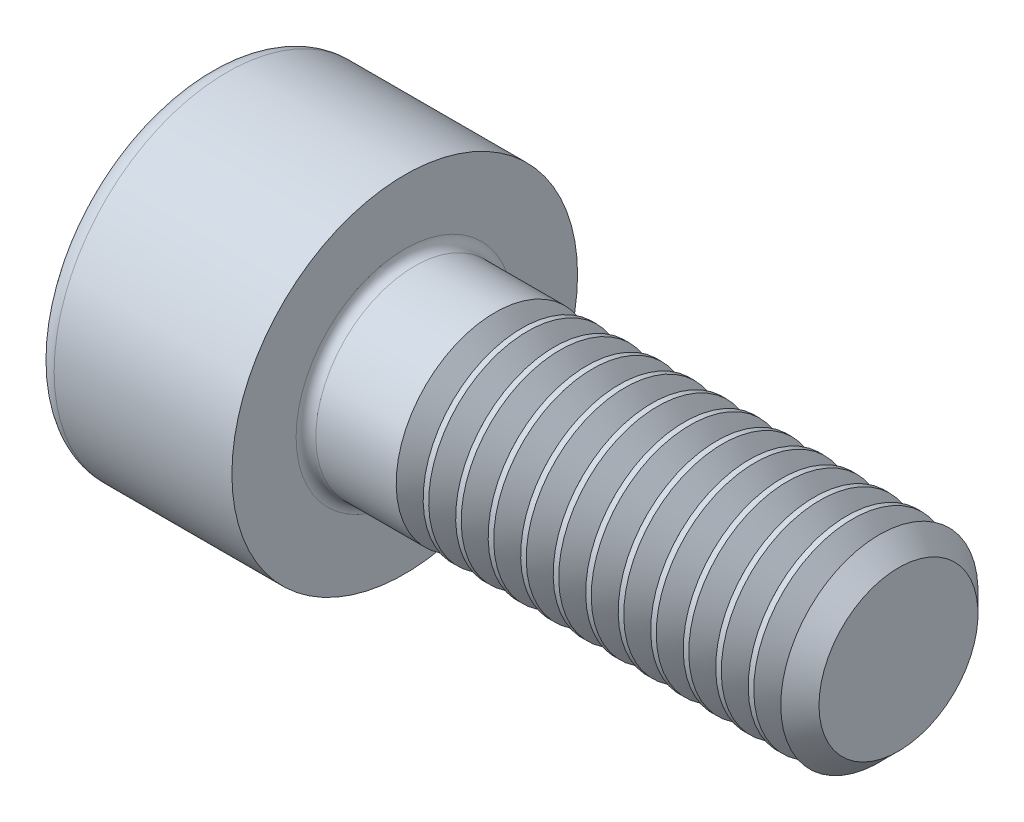
ISO-10303-21;
HEADER;
FILE_DESCRIPTION(('STEP AP214'),'2;1');
FILE_NAME('part.step','',(''),(''),'','','');
FILE_SCHEMA(('AUTOMOTIVE_DESIGN { 1 0 10303 214 1 1 1 1 }'));
ENDSEC;
DATA;
#1=APPLICATION_CONTEXT('core data for automotive mechanical design processes');
#2=APPLICATION_PROTOCOL_DEFINITION('international standard','automotive_design',2000,#1);
#3=PRODUCT_CONTEXT('',#1,'mechanical');
#4=PRODUCT('Part','Part','',(#3));
#5=PRODUCT_RELATED_PRODUCT_CATEGORY('part','',(#4));
#6=PRODUCT_DEFINITION_FORMATION('','',#4);
#7=PRODUCT_DEFINITION_CONTEXT('part definition',#1,'design');
#8=PRODUCT_DEFINITION('design','',#6,#7);
#9=PRODUCT_DEFINITION_SHAPE('','',#8);
#10=(LENGTH_UNIT() NAMED_UNIT(*) SI_UNIT(.MILLI.,.METRE.));
#11=(NAMED_UNIT(*) PLANE_ANGLE_UNIT() SI_UNIT($,.RADIAN.));
#12=(NAMED_UNIT(*) SI_UNIT($,.STERADIAN.) SOLID_ANGLE_UNIT());
#13=UNCERTAINTY_MEASURE_WITH_UNIT(LENGTH_MEASURE(1.E-05),#10,'distance_accuracy_value','');
#14=(GEOMETRIC_REPRESENTATION_CONTEXT(3) GLOBAL_UNCERTAINTY_ASSIGNED_CONTEXT((#13)) GLOBAL_UNIT_ASSIGNED_CONTEXT((#10,
#11,#12)) REPRESENTATION_CONTEXT('',''));
#15=CARTESIAN_POINT('',(0.,0.,0.));
#16=DIRECTION('',(0.,0.,1.));
#17=DIRECTION('',(1.,0.,0.));
#18=AXIS2_PLACEMENT_3D('',#15,#16,#17);
#19=CARTESIAN_POINT('',(0.,0.,0.));
#20=DIRECTION('',(-1.,0.,0.));
#21=DIRECTION('',(0.,0.,1.));
#22=AXIS2_PLACEMENT_3D('',#19,#20,#21);
#23=PLANE('',#22);
#24=DIRECTION('',(0.,-0.499999999999998,0.866025403784439));
#25=VECTOR('',#24,1.);
#26=CARTESIAN_POINT('',(0.,1.74359781295267,0.));
#27=LINE('',#26,#25);
#28=CARTESIAN_POINT('',(0.,1.74359781295267,0.));
#29=VERTEX_POINT('',#28);
#30=CARTESIAN_POINT('',(0.,0.871798906476334,1.51));
#31=VERTEX_POINT('',#30);
#32=EDGE_CURVE('E439',#29,#31,#27,.T.);
#33=ORIENTED_EDGE('',*,*,#32,.T.);
#34=DIRECTION('',(0.,1.,0.));
#35=VECTOR('',#34,1.);
#36=CARTESIAN_POINT('',(0.,-0.871798906476335,1.51));
#37=LINE('',#36,#35);
#38=CARTESIAN_POINT('',(0.,-0.871798906476335,1.51));
#39=VERTEX_POINT('',#38);
#40=EDGE_CURVE('E132',#39,#31,#37,.T.);
#41=ORIENTED_EDGE('',*,*,#40,.F.);
#42=DIRECTION('',(0.,-0.500000000000001,-0.866025403784438));
#43=VECTOR('',#42,1.);
#44=CARTESIAN_POINT('',(0.,-0.871798906476335,1.51));
#45=LINE('',#44,#43);
#46=CARTESIAN_POINT('',(0.,-1.74359781295267,0.));
#47=VERTEX_POINT('',#46);
#48=EDGE_CURVE('E458',#39,#47,#45,.T.);
#49=ORIENTED_EDGE('',*,*,#48,.T.);
#50=DIRECTION('',(0.,0.499999999999998,-0.86602540378444));
#51=VECTOR('',#50,1.);
#52=CARTESIAN_POINT('',(0.,-1.74359781295267,0.));
#53=LINE('',#52,#51);
#54=CARTESIAN_POINT('',(0.,-0.87179890647634,-1.51));
#55=VERTEX_POINT('',#54);
#56=EDGE_CURVE('E461',#47,#55,#53,.T.);
#57=ORIENTED_EDGE('',*,*,#56,.T.);
#58=DIRECTION('',(0.,-1.,0.));
#59=VECTOR('',#58,1.);
#60=CARTESIAN_POINT('',(0.,0.871798906476329,-1.51));
#61=LINE('',#60,#59);
#62=CARTESIAN_POINT('',(0.,0.871798906476329,-1.51));
#63=VERTEX_POINT('',#62);
#64=EDGE_CURVE('E464',#63,#55,#61,.T.);
#65=ORIENTED_EDGE('',*,*,#64,.F.);
#66=DIRECTION('',(0.,-0.500000000000001,-0.866025403784438));
#67=VECTOR('',#66,1.);
#68=CARTESIAN_POINT('',(0.,1.74359781295267,0.));
#69=LINE('',#68,#67);
#70=EDGE_CURVE('E127',#29,#63,#69,.T.);
#71=ORIENTED_EDGE('',*,*,#70,.F.);
#72=EDGE_LOOP('',(#33,#41,#49,#57,#65,#71));
#73=FACE_BOUND('',#72,.T.);
#74=CARTESIAN_POINT('',(0.,0.,0.));
#75=DIRECTION('',(-1.,0.,0.));
#76=DIRECTION('',(0.,0.,1.));
#77=AXIS2_PLACEMENT_3D('',#74,#75,#76);
#78=CIRCLE('',#77,3.1);
#79=CARTESIAN_POINT('',(0.,0.,3.1));
#80=VERTEX_POINT('',#79);
#81=EDGE_CURVE('E44',#80,#80,#78,.T.);
#82=ORIENTED_EDGE('',*,*,#81,.T.);
#83=EDGE_LOOP('',(#82));
#84=FACE_BOUND('',#83,.T.);
#85=ADVANCED_FACE('F35',(#73,#84),#23,.T.);
#86=CARTESIAN_POINT('',(-31.75,0.,0.));
#87=DIRECTION('',(-1.,0.,0.));
#88=DIRECTION('',(0.,0.,1.));
#89=AXIS2_PLACEMENT_3D('',#86,#87,#88);
#90=CYLINDRICAL_SURFACE('',#89,3.5);
#91=CARTESIAN_POINT('',(0.399999999999998,0.,0.));
#92=DIRECTION('',(-1.,0.,0.));
#93=DIRECTION('',(0.,0.,1.));
#94=AXIS2_PLACEMENT_3D('',#91,#92,#93);
#95=CIRCLE('',#94,3.5);
#96=CARTESIAN_POINT('',(0.399999999999998,0.,3.5));
#97=VERTEX_POINT('',#96);
#98=EDGE_CURVE('E11',#97,#97,#95,.F.);
#99=ORIENTED_EDGE('',*,*,#98,.T.);
#100=EDGE_LOOP('',(#99));
#101=FACE_BOUND('',#100,.T.);
#102=CARTESIAN_POINT('',(4.,0.,0.));
#103=DIRECTION('',(-1.,0.,0.));
#104=DIRECTION('',(0.,0.,1.));
#105=AXIS2_PLACEMENT_3D('',#102,#103,#104);
#106=CIRCLE('',#105,3.5);
#107=CARTESIAN_POINT('',(4.,0.,3.5));
#108=VERTEX_POINT('',#107);
#109=EDGE_CURVE('E147',#108,#108,#106,.T.);
#110=ORIENTED_EDGE('',*,*,#109,.T.);
#111=EDGE_LOOP('',(#110));
#112=FACE_BOUND('',#111,.T.);
#113=ADVANCED_FACE('F172',(#101,#112),#90,.T.);
#114=CARTESIAN_POINT('',(4.,3.5,0.));
#115=DIRECTION('',(1.,0.,0.));
#116=DIRECTION('',(0.,0.,-1.));
#117=AXIS2_PLACEMENT_3D('',#114,#115,#116);
#118=PLANE('',#117);
#119=CARTESIAN_POINT('',(4.,0.,0.));
#120=DIRECTION('',(1.,0.,0.));
#121=DIRECTION('',(0.,0.,-1.));
#122=AXIS2_PLACEMENT_3D('',#119,#120,#121);
#123=CIRCLE('',#122,2.19999999999999);
#124=CARTESIAN_POINT('',(4.,0.,-2.19999999999999));
#125=VERTEX_POINT('',#124);
#126=EDGE_CURVE('E150',#125,#125,#123,.F.);
#127=ORIENTED_EDGE('',*,*,#126,.T.);
#128=EDGE_LOOP('',(#127));
#129=FACE_BOUND('',#128,.T.);
#130=ORIENTED_EDGE('',*,*,#109,.F.);
#131=EDGE_LOOP('',(#130));
#132=FACE_BOUND('',#131,.T.);
#133=ADVANCED_FACE('F178',(#129,#132),#118,.T.);
#134=CARTESIAN_POINT('',(-31.75,0.,0.));
#135=DIRECTION('',(-1.,0.,0.));
#136=DIRECTION('',(0.,0.,1.));
#137=AXIS2_PLACEMENT_3D('',#134,#135,#136);
#138=CYLINDRICAL_SURFACE('',#137,1.99999999999999);
#139=CARTESIAN_POINT('',(5.82691906009821,0.,0.));
#140=DIRECTION('',(-1.,0.,0.));
#141=DIRECTION('',(0.,-1.,0.));
#142=AXIS2_PLACEMENT_3D('',#139,#140,#141);
#143=CIRCLE('',#142,2.);
#144=CARTESIAN_POINT('',(5.82691906009821,-2.,0.));
#145=VERTEX_POINT('',#144);
#146=EDGE_CURVE('E434',#145,#145,#143,.T.);
#147=ORIENTED_EDGE('',*,*,#146,.T.);
#148=EDGE_LOOP('',(#147));
#149=FACE_BOUND('',#148,.T.);
#150=CARTESIAN_POINT('',(4.2,0.,0.));
#151=DIRECTION('',(1.,0.,0.));
#152=DIRECTION('',(0.,0.,-1.));
#153=AXIS2_PLACEMENT_3D('',#150,#151,#152);
#154=CIRCLE('',#153,1.99999999999999);
#155=CARTESIAN_POINT('',(4.2,0.,-1.99999999999999));
#156=VERTEX_POINT('',#155);
#157=EDGE_CURVE('E153',#156,#156,#154,.T.);
#158=ORIENTED_EDGE('',*,*,#157,.T.);
#159=EDGE_LOOP('',(#158));
#160=FACE_BOUND('',#159,.T.);
#161=ADVANCED_FACE('F168',(#149,#160),#138,.T.);
#162=CARTESIAN_POINT('',(4.2,0.,0.));
#163=DIRECTION('',(1.,0.,0.));
#164=DIRECTION('',(0.,0.,-1.));
#165=AXIS2_PLACEMENT_3D('',#162,#163,#164);
#166=TOROIDAL_SURFACE('',#165,2.19999999999999,0.2);
#167=ORIENTED_EDGE('',*,*,#157,.F.);
#168=EDGE_LOOP('',(#167));
#169=FACE_BOUND('',#168,.T.);
#170=ORIENTED_EDGE('',*,*,#126,.F.);
#171=EDGE_LOOP('',(#170));
#172=FACE_BOUND('',#171,.T.);
#173=ADVANCED_FACE('F161',(#169,#172),#166,.F.);
#174=CARTESIAN_POINT('',(0.399999999999998,0.,0.));
#175=DIRECTION('',(-1.,0.,0.));
#176=DIRECTION('',(0.,0.,1.));
#177=AXIS2_PLACEMENT_3D('',#174,#175,#176);
#178=TOROIDAL_SURFACE('',#177,3.1,0.4);
#179=ORIENTED_EDGE('',*,*,#98,.F.);
#180=EDGE_LOOP('',(#179));
#181=FACE_BOUND('',#180,.T.);
#182=ORIENTED_EDGE('',*,*,#81,.F.);
#183=EDGE_LOOP('',(#182));
#184=FACE_BOUND('',#183,.T.);
#185=ADVANCED_FACE('F37',(#181,#184),#178,.T.);
#186=CARTESIAN_POINT('',(2.,1.74359781295267,0.));
#187=DIRECTION('',(0.,-0.86602540378444,-0.499999999999999));
#188=DIRECTION('',(0.,0.499999999999998,-0.866025403784439));
#189=AXIS2_PLACEMENT_3D('',#186,#187,#188);
#190=PLANE('',#189);
#191=ORIENTED_EDGE('',*,*,#32,.F.);
#192=DIRECTION('',(-1.,0.,0.));
#193=VECTOR('',#192,1.);
#194=CARTESIAN_POINT('',(2.,1.74359781295267,0.));
#195=LINE('',#194,#193);
#196=CARTESIAN_POINT('',(2.,1.74359781295267,0.));
#197=VERTEX_POINT('',#196);
#198=EDGE_CURVE('E455',#197,#29,#195,.T.);
#199=ORIENTED_EDGE('',*,*,#198,.F.);
#200=DIRECTION('',(0.,-0.499999999999998,0.866025403784439));
#201=VECTOR('',#200,1.);
#202=CARTESIAN_POINT('',(2.,1.74359781295267,0.));
#203=LINE('',#202,#201);
#204=CARTESIAN_POINT('',(2.,1.3076983597145,0.754999999999995));
#205=VERTEX_POINT('',#204);
#206=EDGE_CURVE('E119',#197,#205,#203,.T.);
#207=ORIENTED_EDGE('',*,*,#206,.T.);
#208=CARTESIAN_POINT('',(2.,0.871798906476334,1.51));
#209=VERTEX_POINT('',#208);
#210=EDGE_CURVE('E110',#205,#209,#203,.T.);
#211=ORIENTED_EDGE('',*,*,#210,.T.);
#212=DIRECTION('',(-1.,0.,0.));
#213=VECTOR('',#212,1.);
#214=CARTESIAN_POINT('',(2.,0.871798906476334,1.51));
#215=LINE('',#214,#213);
#216=EDGE_CURVE('E124',#209,#31,#215,.T.);
#217=ORIENTED_EDGE('',*,*,#216,.T.);
#218=EDGE_LOOP('',(#191,#199,#207,#211,#217));
#219=FACE_BOUND('',#218,.T.);
#220=ADVANCED_FACE('F123',(#219),#190,.T.);
#221=CARTESIAN_POINT('',(2.,-0.871798906476335,1.51));
#222=DIRECTION('',(0.,0.,1.));
#223=DIRECTION('',(0.,-1.,0.));
#224=AXIS2_PLACEMENT_3D('',#221,#222,#223);
#225=PLANE('',#224);
#226=ORIENTED_EDGE('',*,*,#40,.T.);
#227=ORIENTED_EDGE('',*,*,#216,.F.);
#228=DIRECTION('',(0.,1.,0.));
#229=VECTOR('',#228,1.);
#230=CARTESIAN_POINT('',(2.,-0.871798906476335,1.51));
#231=LINE('',#230,#229);
#232=CARTESIAN_POINT('',(2.,0.,1.51));
#233=VERTEX_POINT('',#232);
#234=EDGE_CURVE('E107',#233,#209,#231,.T.);
#235=ORIENTED_EDGE('',*,*,#234,.F.);
#236=CARTESIAN_POINT('',(2.,-0.871798906476335,1.51));
#237=VERTEX_POINT('',#236);
#238=EDGE_CURVE('E118',#237,#233,#231,.T.);
#239=ORIENTED_EDGE('',*,*,#238,.F.);
#240=DIRECTION('',(-1.,0.,0.));
#241=VECTOR('',#240,1.);
#242=CARTESIAN_POINT('',(2.,-0.871798906476335,1.51));
#243=LINE('',#242,#241);
#244=EDGE_CURVE('E134',#237,#39,#243,.T.);
#245=ORIENTED_EDGE('',*,*,#244,.T.);
#246=EDGE_LOOP('',(#226,#227,#235,#239,#245));
#247=FACE_BOUND('',#246,.T.);
#248=ADVANCED_FACE('F129',(#247),#225,.F.);
#249=CARTESIAN_POINT('',(2.,-0.871798906476335,1.51));
#250=DIRECTION('',(0.,0.866025403784438,-0.500000000000001));
#251=DIRECTION('',(0.,0.500000000000001,0.866025403784438));
#252=AXIS2_PLACEMENT_3D('',#249,#250,#251);
#253=PLANE('',#252);
#254=ORIENTED_EDGE('',*,*,#48,.F.);
#255=ORIENTED_EDGE('',*,*,#244,.F.);
#256=DIRECTION('',(0.,-0.500000000000001,-0.866025403784438));
#257=VECTOR('',#256,1.);
#258=CARTESIAN_POINT('',(2.,-0.871798906476335,1.51));
#259=LINE('',#258,#257);
#260=CARTESIAN_POINT('',(2.,-1.3076983597145,0.755000000000002));
#261=VERTEX_POINT('',#260);
#262=EDGE_CURVE('E442',#237,#261,#259,.T.);
#263=ORIENTED_EDGE('',*,*,#262,.T.);
#264=CARTESIAN_POINT('',(2.,-1.74359781295267,0.));
#265=VERTEX_POINT('',#264);
#266=EDGE_CURVE('E441',#261,#265,#259,.T.);
#267=ORIENTED_EDGE('',*,*,#266,.T.);
#268=DIRECTION('',(-1.,0.,0.));
#269=VECTOR('',#268,1.);
#270=CARTESIAN_POINT('',(2.,-1.74359781295267,0.));
#271=LINE('',#270,#269);
#272=EDGE_CURVE('E139',#265,#47,#271,.T.);
#273=ORIENTED_EDGE('',*,*,#272,.T.);
#274=EDGE_LOOP('',(#254,#255,#263,#267,#273));
#275=FACE_BOUND('',#274,.T.);
#276=ADVANCED_FACE('F206',(#275),#253,.T.);
#277=CARTESIAN_POINT('',(2.,-1.74359781295267,0.));
#278=DIRECTION('',(0.,0.86602540378444,0.499999999999998));
#279=DIRECTION('',(0.,-0.499999999999998,0.86602540378444));
#280=AXIS2_PLACEMENT_3D('',#277,#278,#279);
#281=PLANE('',#280);
#282=ORIENTED_EDGE('',*,*,#56,.F.);
#283=ORIENTED_EDGE('',*,*,#272,.F.);
#284=DIRECTION('',(0.,0.499999999999998,-0.86602540378444));
#285=VECTOR('',#284,1.);
#286=CARTESIAN_POINT('',(2.,-1.74359781295267,0.));
#287=LINE('',#286,#285);
#288=CARTESIAN_POINT('',(2.,-1.30769835971451,-0.754999999999999));
#289=VERTEX_POINT('',#288);
#290=EDGE_CURVE('E446',#265,#289,#287,.T.);
#291=ORIENTED_EDGE('',*,*,#290,.T.);
#292=CARTESIAN_POINT('',(2.,-0.87179890647634,-1.51));
#293=VERTEX_POINT('',#292);
#294=EDGE_CURVE('E445',#289,#293,#287,.T.);
#295=ORIENTED_EDGE('',*,*,#294,.T.);
#296=DIRECTION('',(-1.,0.,0.));
#297=VECTOR('',#296,1.);
#298=CARTESIAN_POINT('',(2.,-0.87179890647634,-1.51));
#299=LINE('',#298,#297);
#300=EDGE_CURVE('E473',#293,#55,#299,.T.);
#301=ORIENTED_EDGE('',*,*,#300,.T.);
#302=EDGE_LOOP('',(#282,#283,#291,#295,#301));
#303=FACE_BOUND('',#302,.T.);
#304=ADVANCED_FACE('F209',(#303),#281,.T.);
#305=CARTESIAN_POINT('',(2.,0.871798906476329,-1.51));
#306=DIRECTION('',(0.,0.,-1.));
#307=DIRECTION('',(0.,1.,0.));
#308=AXIS2_PLACEMENT_3D('',#305,#306,#307);
#309=PLANE('',#308);
#310=ORIENTED_EDGE('',*,*,#64,.T.);
#311=ORIENTED_EDGE('',*,*,#300,.F.);
#312=DIRECTION('',(0.,-1.,0.));
#313=VECTOR('',#312,1.);
#314=CARTESIAN_POINT('',(2.,0.871798906476329,-1.51));
#315=LINE('',#314,#313);
#316=CARTESIAN_POINT('',(2.,0.,-1.51));
#317=VERTEX_POINT('',#316);
#318=EDGE_CURVE('E449',#317,#293,#315,.T.);
#319=ORIENTED_EDGE('',*,*,#318,.F.);
#320=CARTESIAN_POINT('',(2.,0.871798906476329,-1.51));
#321=VERTEX_POINT('',#320);
#322=EDGE_CURVE('E51',#321,#317,#315,.T.);
#323=ORIENTED_EDGE('',*,*,#322,.F.);
#324=DIRECTION('',(-1.,0.,0.));
#325=VECTOR('',#324,1.);
#326=CARTESIAN_POINT('',(2.,0.871798906476329,-1.51));
#327=LINE('',#326,#325);
#328=EDGE_CURVE('E470',#321,#63,#327,.T.);
#329=ORIENTED_EDGE('',*,*,#328,.T.);
#330=EDGE_LOOP('',(#310,#311,#319,#323,#329));
#331=FACE_BOUND('',#330,.T.);
#332=ADVANCED_FACE('F213',(#331),#309,.F.);
#333=CARTESIAN_POINT('',(2.,1.74359781295267,0.));
#334=DIRECTION('',(0.,0.866025403784438,-0.500000000000001));
#335=DIRECTION('',(0.,0.500000000000001,0.866025403784438));
#336=AXIS2_PLACEMENT_3D('',#333,#334,#335);
#337=PLANE('',#336);
#338=ORIENTED_EDGE('',*,*,#70,.T.);
#339=ORIENTED_EDGE('',*,*,#328,.F.);
#340=DIRECTION('',(0.,-0.500000000000001,-0.866025403784438));
#341=VECTOR('',#340,1.);
#342=CARTESIAN_POINT('',(2.,1.74359781295267,0.));
#343=LINE('',#342,#341);
#344=CARTESIAN_POINT('',(2.,1.3076983597145,-0.755000000000001));
#345=VERTEX_POINT('',#344);
#346=EDGE_CURVE('E451',#345,#321,#343,.T.);
#347=ORIENTED_EDGE('',*,*,#346,.F.);
#348=EDGE_CURVE('E452',#197,#345,#343,.T.);
#349=ORIENTED_EDGE('',*,*,#348,.F.);
#350=ORIENTED_EDGE('',*,*,#198,.T.);
#351=EDGE_LOOP('',(#338,#339,#347,#349,#350));
#352=FACE_BOUND('',#351,.T.);
#353=ADVANCED_FACE('F217',(#352),#337,.F.);
#354=CARTESIAN_POINT('',(2.,2.615396719429,-1.51000000000001));
#355=DIRECTION('',(1.,0.,0.));
#356=DIRECTION('',(0.,0.,-1.));
#357=AXIS2_PLACEMENT_3D('',#354,#355,#356);
#358=PLANE('',#357);
#359=ORIENTED_EDGE('',*,*,#318,.T.);
#360=ORIENTED_EDGE('',*,*,#294,.F.);
#361=CARTESIAN_POINT('',(2.,0.,0.));
#362=DIRECTION('',(-1.,0.,0.));
#363=DIRECTION('',(0.,0.,1.));
#364=AXIS2_PLACEMENT_3D('',#361,#362,#363);
#365=CIRCLE('',#364,1.51);
#366=EDGE_CURVE('E490',#317,#289,#365,.T.);
#367=ORIENTED_EDGE('',*,*,#366,.F.);
#368=EDGE_LOOP('',(#359,#360,#367));
#369=FACE_BOUND('',#368,.T.);
#370=ADVANCED_FACE('F221',(#369),#358,.F.);
#371=ORIENTED_EDGE('',*,*,#290,.F.);
#372=ORIENTED_EDGE('',*,*,#266,.F.);
#373=EDGE_CURVE('E137',#289,#261,#365,.T.);
#374=ORIENTED_EDGE('',*,*,#373,.F.);
#375=EDGE_LOOP('',(#371,#372,#374));
#376=FACE_BOUND('',#375,.T.);
#377=ADVANCED_FACE('F225',(#376),#358,.F.);
#378=ORIENTED_EDGE('',*,*,#262,.F.);
#379=ORIENTED_EDGE('',*,*,#238,.T.);
#380=EDGE_CURVE('E133',#261,#233,#365,.T.);
#381=ORIENTED_EDGE('',*,*,#380,.F.);
#382=EDGE_LOOP('',(#378,#379,#381));
#383=FACE_BOUND('',#382,.T.);
#384=ADVANCED_FACE('F499',(#383),#358,.F.);
#385=ORIENTED_EDGE('',*,*,#234,.T.);
#386=ORIENTED_EDGE('',*,*,#210,.F.);
#387=EDGE_CURVE('E113',#233,#205,#365,.T.);
#388=ORIENTED_EDGE('',*,*,#387,.F.);
#389=EDGE_LOOP('',(#385,#386,#388));
#390=FACE_BOUND('',#389,.T.);
#391=ADVANCED_FACE('F109',(#390),#358,.F.);
#392=ORIENTED_EDGE('',*,*,#206,.F.);
#393=ORIENTED_EDGE('',*,*,#348,.T.);
#394=EDGE_CURVE('E144',#205,#345,#365,.T.);
#395=ORIENTED_EDGE('',*,*,#394,.F.);
#396=EDGE_LOOP('',(#392,#393,#395));
#397=FACE_BOUND('',#396,.T.);
#398=ADVANCED_FACE('F485',(#397),#358,.F.);
#399=ORIENTED_EDGE('',*,*,#346,.T.);
#400=ORIENTED_EDGE('',*,*,#322,.T.);
#401=EDGE_CURVE('E489',#345,#317,#365,.T.);
#402=ORIENTED_EDGE('',*,*,#401,.F.);
#403=EDGE_LOOP('',(#399,#400,#402));
#404=FACE_BOUND('',#403,.T.);
#405=ADVANCED_FACE('F202',(#404),#358,.F.);
#406=CARTESIAN_POINT('',(2.,0.,0.));
#407=DIRECTION('',(-1.,0.,0.));
#408=DIRECTION('',(0.,0.,1.));
#409=AXIS2_PLACEMENT_3D('',#406,#407,#408);
#410=CONICAL_SURFACE('',#409,1.51,1.04719755119659);
#411=CARTESIAN_POINT('',(2.87179890647635,0.,0.));
#412=VERTEX_POINT('',#411);
#413=VERTEX_LOOP('',#412);
#414=FACE_BOUND('',#413,.T.);
#415=ORIENTED_EDGE('',*,*,#387,.T.);
#416=ORIENTED_EDGE('',*,*,#394,.T.);
#417=ORIENTED_EDGE('',*,*,#401,.T.);
#418=ORIENTED_EDGE('',*,*,#366,.T.);
#419=ORIENTED_EDGE('',*,*,#373,.T.);
#420=ORIENTED_EDGE('',*,*,#380,.T.);
#421=EDGE_LOOP('',(#415,#416,#417,#418,#419,#420));
#422=FACE_BOUND('',#421,.T.);
#423=ADVANCED_FACE('F199',(#414,#422),#410,.F.);
#424=CARTESIAN_POINT('',(6.37308093990179,0.,0.));
#425=DIRECTION('',(1.,0.,0.));
#426=DIRECTION('',(0.,1.,0.));
#427=AXIS2_PLACEMENT_3D('',#424,#425,#426);
#428=CONICAL_SURFACE('',#427,2.,0.959931088596882);
#429=CARTESIAN_POINT('',(6.1,0.,0.));
#430=DIRECTION('',(-1.,0.,0.));
#431=DIRECTION('',(0.,-1.,0.));
#432=AXIS2_PLACEMENT_3D('',#429,#430,#431);
#433=CIRCLE('',#432,1.61);
#434=CARTESIAN_POINT('',(6.1,-1.61,0.));
#435=VERTEX_POINT('',#434);
#436=EDGE_CURVE('E431',#435,#435,#433,.T.);
#437=ORIENTED_EDGE('',*,*,#436,.F.);
#438=EDGE_LOOP('',(#437));
#439=FACE_BOUND('',#438,.T.);
#440=CARTESIAN_POINT('',(6.37308093990179,0.,0.));
#441=DIRECTION('',(-1.,0.,0.));
#442=DIRECTION('',(0.,-1.,0.));
#443=AXIS2_PLACEMENT_3D('',#440,#441,#442);
#444=CIRCLE('',#443,2.);
#445=CARTESIAN_POINT('',(6.37308093990179,-2.,0.));
#446=VERTEX_POINT('',#445);
#447=EDGE_CURVE('E437',#446,#446,#444,.T.);
#448=ORIENTED_EDGE('',*,*,#447,.T.);
#449=EDGE_LOOP('',(#448));
#450=FACE_BOUND('',#449,.T.);
#451=ADVANCED_FACE('F201',(#439,#450),#428,.T.);
#452=CARTESIAN_POINT('',(6.1,0.,0.));
#453=DIRECTION('',(-1.,0.,0.));
#454=DIRECTION('',(0.,-1.,0.));
#455=AXIS2_PLACEMENT_3D('',#452,#453,#454);
#456=CONICAL_SURFACE('',#455,1.61,0.959931088596876);
#457=ORIENTED_EDGE('',*,*,#146,.F.);
#458=EDGE_LOOP('',(#457));
#459=FACE_BOUND('',#458,.T.);
#460=ORIENTED_EDGE('',*,*,#436,.T.);
#461=EDGE_LOOP('',(#460));
#462=FACE_BOUND('',#461,.T.);
#463=ADVANCED_FACE('F229',(#459,#462),#456,.T.);
#464=CARTESIAN_POINT('',(6.48525239343154,0.,0.));
#465=DIRECTION('',(-1.,0.,0.));
#466=DIRECTION('',(0.,-1.,0.));
#467=AXIS2_PLACEMENT_3D('',#464,#465,#466);
#468=CIRCLE('',#467,2.);
#469=CARTESIAN_POINT('',(6.48525239343154,-2.,0.));
#470=VERTEX_POINT('',#469);
#471=EDGE_CURVE('E425',#470,#470,#468,.T.);
#472=ORIENTED_EDGE('',*,*,#471,.T.);
#473=EDGE_LOOP('',(#472));
#474=FACE_BOUND('',#473,.T.);
#475=ORIENTED_EDGE('',*,*,#447,.F.);
#476=EDGE_LOOP('',(#475));
#477=FACE_BOUND('',#476,.T.);
#478=ADVANCED_FACE('F189',(#474,#477),#138,.T.);
#479=CARTESIAN_POINT('',(7.03141427323512,0.,0.));
#480=DIRECTION('',(1.,0.,0.));
#481=DIRECTION('',(0.,1.,0.));
#482=AXIS2_PLACEMENT_3D('',#479,#480,#481);
#483=CONICAL_SURFACE('',#482,2.,0.959931088596882);
#484=CARTESIAN_POINT('',(6.75833333333333,0.,0.));
#485=DIRECTION('',(-1.,0.,0.));
#486=DIRECTION('',(0.,-1.,0.));
#487=AXIS2_PLACEMENT_3D('',#484,#485,#486);
#488=CIRCLE('',#487,1.61);
#489=CARTESIAN_POINT('',(6.75833333333333,-1.61,0.));
#490=VERTEX_POINT('',#489);
#491=EDGE_CURVE('E422',#490,#490,#488,.T.);
#492=ORIENTED_EDGE('',*,*,#491,.F.);
#493=EDGE_LOOP('',(#492));
#494=FACE_BOUND('',#493,.T.);
#495=CARTESIAN_POINT('',(7.03141427323512,0.,0.));
#496=DIRECTION('',(-1.,0.,0.));
#497=DIRECTION('',(0.,-1.,0.));
#498=AXIS2_PLACEMENT_3D('',#495,#496,#497);
#499=CIRCLE('',#498,2.);
#500=CARTESIAN_POINT('',(7.03141427323512,-2.,0.));
#501=VERTEX_POINT('',#500);
#502=EDGE_CURVE('E428',#501,#501,#499,.T.);
#503=ORIENTED_EDGE('',*,*,#502,.T.);
#504=EDGE_LOOP('',(#503));
#505=FACE_BOUND('',#504,.T.);
#506=ADVANCED_FACE('F234',(#494,#505),#483,.T.);
#507=CARTESIAN_POINT('',(6.75833333333333,0.,0.));
#508=DIRECTION('',(-1.,0.,0.));
#509=DIRECTION('',(0.,-1.,0.));
#510=AXIS2_PLACEMENT_3D('',#507,#508,#509);
#511=CONICAL_SURFACE('',#510,1.61,0.959931088596876);
#512=ORIENTED_EDGE('',*,*,#471,.F.);
#513=EDGE_LOOP('',(#512));
#514=FACE_BOUND('',#513,.T.);
#515=ORIENTED_EDGE('',*,*,#491,.T.);
#516=EDGE_LOOP('',(#515));
#517=FACE_BOUND('',#516,.T.);
#518=ADVANCED_FACE('F237',(#514,#517),#511,.T.);
#519=CARTESIAN_POINT('',(7.14358572676488,0.,0.));
#520=DIRECTION('',(-1.,0.,0.));
#521=DIRECTION('',(0.,-1.,0.));
#522=AXIS2_PLACEMENT_3D('',#519,#520,#521);
#523=CIRCLE('',#522,2.);
#524=CARTESIAN_POINT('',(7.14358572676488,-2.,0.));
#525=VERTEX_POINT('',#524);
#526=EDGE_CURVE('E416',#525,#525,#523,.T.);
#527=ORIENTED_EDGE('',*,*,#526,.T.);
#528=EDGE_LOOP('',(#527));
#529=FACE_BOUND('',#528,.T.);
#530=ORIENTED_EDGE('',*,*,#502,.F.);
#531=EDGE_LOOP('',(#530));
#532=FACE_BOUND('',#531,.T.);
#533=ADVANCED_FACE('F241',(#529,#532),#138,.T.);
#534=CARTESIAN_POINT('',(7.68974760656845,0.,0.));
#535=DIRECTION('',(1.,0.,0.));
#536=DIRECTION('',(0.,1.,0.));
#537=AXIS2_PLACEMENT_3D('',#534,#535,#536);
#538=CONICAL_SURFACE('',#537,2.,0.959931088596882);
#539=CARTESIAN_POINT('',(7.41666666666667,0.,0.));
#540=DIRECTION('',(-1.,0.,0.));
#541=DIRECTION('',(0.,-1.,0.));
#542=AXIS2_PLACEMENT_3D('',#539,#540,#541);
#543=CIRCLE('',#542,1.61);
#544=CARTESIAN_POINT('',(7.41666666666667,-1.61,0.));
#545=VERTEX_POINT('',#544);
#546=EDGE_CURVE('E413',#545,#545,#543,.T.);
#547=ORIENTED_EDGE('',*,*,#546,.F.);
#548=EDGE_LOOP('',(#547));
#549=FACE_BOUND('',#548,.T.);
#550=CARTESIAN_POINT('',(7.68974760656845,0.,0.));
#551=DIRECTION('',(-1.,0.,0.));
#552=DIRECTION('',(0.,-1.,0.));
#553=AXIS2_PLACEMENT_3D('',#550,#551,#552);
#554=CIRCLE('',#553,2.);
#555=CARTESIAN_POINT('',(7.68974760656845,-2.,0.));
#556=VERTEX_POINT('',#555);
#557=EDGE_CURVE('E419',#556,#556,#554,.T.);
#558=ORIENTED_EDGE('',*,*,#557,.T.);
#559=EDGE_LOOP('',(#558));
#560=FACE_BOUND('',#559,.T.);
#561=ADVANCED_FACE('F243',(#549,#560),#538,.T.);
#562=CARTESIAN_POINT('',(7.41666666666667,0.,0.));
#563=DIRECTION('',(-1.,0.,0.));
#564=DIRECTION('',(0.,-1.,0.));
#565=AXIS2_PLACEMENT_3D('',#562,#563,#564);
#566=CONICAL_SURFACE('',#565,1.61,0.959931088596876);
#567=ORIENTED_EDGE('',*,*,#526,.F.);
#568=EDGE_LOOP('',(#567));
#569=FACE_BOUND('',#568,.T.);
#570=ORIENTED_EDGE('',*,*,#546,.T.);
#571=EDGE_LOOP('',(#570));
#572=FACE_BOUND('',#571,.T.);
#573=ADVANCED_FACE('F246',(#569,#572),#566,.T.);
#574=CARTESIAN_POINT('',(7.80191906009821,0.,0.));
#575=DIRECTION('',(-1.,0.,0.));
#576=DIRECTION('',(0.,-1.,0.));
#577=AXIS2_PLACEMENT_3D('',#574,#575,#576);
#578=CIRCLE('',#577,2.);
#579=CARTESIAN_POINT('',(7.80191906009821,-2.,0.));
#580=VERTEX_POINT('',#579);
#581=EDGE_CURVE('E407',#580,#580,#578,.T.);
#582=ORIENTED_EDGE('',*,*,#581,.T.);
#583=EDGE_LOOP('',(#582));
#584=FACE_BOUND('',#583,.T.);
#585=ORIENTED_EDGE('',*,*,#557,.F.);
#586=EDGE_LOOP('',(#585));
#587=FACE_BOUND('',#586,.T.);
#588=ADVANCED_FACE('F250',(#584,#587),#138,.T.);
#589=CARTESIAN_POINT('',(8.34808093990179,0.,0.));
#590=DIRECTION('',(1.,0.,0.));
#591=DIRECTION('',(0.,1.,0.));
#592=AXIS2_PLACEMENT_3D('',#589,#590,#591);
#593=CONICAL_SURFACE('',#592,2.,0.959931088596882);
#594=CARTESIAN_POINT('',(8.075,0.,0.));
#595=DIRECTION('',(-1.,0.,0.));
#596=DIRECTION('',(0.,-1.,0.));
#597=AXIS2_PLACEMENT_3D('',#594,#595,#596);
#598=CIRCLE('',#597,1.61);
#599=CARTESIAN_POINT('',(8.075,-1.61,0.));
#600=VERTEX_POINT('',#599);
#601=EDGE_CURVE('E404',#600,#600,#598,.T.);
#602=ORIENTED_EDGE('',*,*,#601,.F.);
#603=EDGE_LOOP('',(#602));
#604=FACE_BOUND('',#603,.T.);
#605=CARTESIAN_POINT('',(8.34808093990179,0.,0.));
#606=DIRECTION('',(-1.,0.,0.));
#607=DIRECTION('',(0.,-1.,0.));
#608=AXIS2_PLACEMENT_3D('',#605,#606,#607);
#609=CIRCLE('',#608,2.);
#610=CARTESIAN_POINT('',(8.34808093990179,-2.,0.));
#611=VERTEX_POINT('',#610);
#612=EDGE_CURVE('E410',#611,#611,#609,.T.);
#613=ORIENTED_EDGE('',*,*,#612,.T.);
#614=EDGE_LOOP('',(#613));
#615=FACE_BOUND('',#614,.T.);
#616=ADVANCED_FACE('F252',(#604,#615),#593,.T.);
#617=CARTESIAN_POINT('',(8.075,0.,0.));
#618=DIRECTION('',(-1.,0.,0.));
#619=DIRECTION('',(0.,-1.,0.));
#620=AXIS2_PLACEMENT_3D('',#617,#618,#619);
#621=CONICAL_SURFACE('',#620,1.61,0.959931088596876);
#622=ORIENTED_EDGE('',*,*,#581,.F.);
#623=EDGE_LOOP('',(#622));
#624=FACE_BOUND('',#623,.T.);
#625=ORIENTED_EDGE('',*,*,#601,.T.);
#626=EDGE_LOOP('',(#625));
#627=FACE_BOUND('',#626,.T.);
#628=ADVANCED_FACE('F255',(#624,#627),#621,.T.);
#629=CARTESIAN_POINT('',(8.46025239343154,0.,0.));
#630=DIRECTION('',(-1.,0.,0.));
#631=DIRECTION('',(0.,-1.,0.));
#632=AXIS2_PLACEMENT_3D('',#629,#630,#631);
#633=CIRCLE('',#632,2.);
#634=CARTESIAN_POINT('',(8.46025239343154,-2.,0.));
#635=VERTEX_POINT('',#634);
#636=EDGE_CURVE('E398',#635,#635,#633,.T.);
#637=ORIENTED_EDGE('',*,*,#636,.T.);
#638=EDGE_LOOP('',(#637));
#639=FACE_BOUND('',#638,.T.);
#640=ORIENTED_EDGE('',*,*,#612,.F.);
#641=EDGE_LOOP('',(#640));
#642=FACE_BOUND('',#641,.T.);
#643=ADVANCED_FACE('F259',(#639,#642),#138,.T.);
#644=CARTESIAN_POINT('',(9.00641427323512,0.,0.));
#645=DIRECTION('',(1.,0.,0.));
#646=DIRECTION('',(0.,1.,0.));
#647=AXIS2_PLACEMENT_3D('',#644,#645,#646);
#648=CONICAL_SURFACE('',#647,2.,0.959931088596882);
#649=CARTESIAN_POINT('',(8.73333333333333,0.,0.));
#650=DIRECTION('',(-1.,0.,0.));
#651=DIRECTION('',(0.,-1.,0.));
#652=AXIS2_PLACEMENT_3D('',#649,#650,#651);
#653=CIRCLE('',#652,1.61);
#654=CARTESIAN_POINT('',(8.73333333333333,-1.61,0.));
#655=VERTEX_POINT('',#654);
#656=EDGE_CURVE('E395',#655,#655,#653,.T.);
#657=ORIENTED_EDGE('',*,*,#656,.F.);
#658=EDGE_LOOP('',(#657));
#659=FACE_BOUND('',#658,.T.);
#660=CARTESIAN_POINT('',(9.00641427323512,0.,0.));
#661=DIRECTION('',(-1.,0.,0.));
#662=DIRECTION('',(0.,-1.,0.));
#663=AXIS2_PLACEMENT_3D('',#660,#661,#662);
#664=CIRCLE('',#663,2.);
#665=CARTESIAN_POINT('',(9.00641427323512,-2.,0.));
#666=VERTEX_POINT('',#665);
#667=EDGE_CURVE('E401',#666,#666,#664,.T.);
#668=ORIENTED_EDGE('',*,*,#667,.T.);
#669=EDGE_LOOP('',(#668));
#670=FACE_BOUND('',#669,.T.);
#671=ADVANCED_FACE('F261',(#659,#670),#648,.T.);
#672=CARTESIAN_POINT('',(8.73333333333333,0.,0.));
#673=DIRECTION('',(-1.,0.,0.));
#674=DIRECTION('',(0.,-1.,0.));
#675=AXIS2_PLACEMENT_3D('',#672,#673,#674);
#676=CONICAL_SURFACE('',#675,1.61,0.959931088596876);
#677=ORIENTED_EDGE('',*,*,#636,.F.);
#678=EDGE_LOOP('',(#677));
#679=FACE_BOUND('',#678,.T.);
#680=ORIENTED_EDGE('',*,*,#656,.T.);
#681=EDGE_LOOP('',(#680));
#682=FACE_BOUND('',#681,.T.);
#683=ADVANCED_FACE('F264',(#679,#682),#676,.T.);
#684=CARTESIAN_POINT('',(9.11858572676488,0.,0.));
#685=DIRECTION('',(-1.,0.,0.));
#686=DIRECTION('',(0.,-1.,0.));
#687=AXIS2_PLACEMENT_3D('',#684,#685,#686);
#688=CIRCLE('',#687,2.);
#689=CARTESIAN_POINT('',(9.11858572676488,-2.,0.));
#690=VERTEX_POINT('',#689);
#691=EDGE_CURVE('E389',#690,#690,#688,.T.);
#692=ORIENTED_EDGE('',*,*,#691,.T.);
#693=EDGE_LOOP('',(#692));
#694=FACE_BOUND('',#693,.T.);
#695=ORIENTED_EDGE('',*,*,#667,.F.);
#696=EDGE_LOOP('',(#695));
#697=FACE_BOUND('',#696,.T.);
#698=ADVANCED_FACE('F268',(#694,#697),#138,.T.);
#699=CARTESIAN_POINT('',(9.66474760656845,0.,0.));
#700=DIRECTION('',(1.,0.,0.));
#701=DIRECTION('',(0.,1.,0.));
#702=AXIS2_PLACEMENT_3D('',#699,#700,#701);
#703=CONICAL_SURFACE('',#702,2.,0.959931088596882);
#704=CARTESIAN_POINT('',(9.39166666666667,0.,0.));
#705=DIRECTION('',(-1.,0.,0.));
#706=DIRECTION('',(0.,-1.,0.));
#707=AXIS2_PLACEMENT_3D('',#704,#705,#706);
#708=CIRCLE('',#707,1.61);
#709=CARTESIAN_POINT('',(9.39166666666667,-1.61,0.));
#710=VERTEX_POINT('',#709);
#711=EDGE_CURVE('E386',#710,#710,#708,.T.);
#712=ORIENTED_EDGE('',*,*,#711,.F.);
#713=EDGE_LOOP('',(#712));
#714=FACE_BOUND('',#713,.T.);
#715=CARTESIAN_POINT('',(9.66474760656845,0.,0.));
#716=DIRECTION('',(-1.,0.,0.));
#717=DIRECTION('',(0.,-1.,0.));
#718=AXIS2_PLACEMENT_3D('',#715,#716,#717);
#719=CIRCLE('',#718,2.);
#720=CARTESIAN_POINT('',(9.66474760656845,-2.,0.));
#721=VERTEX_POINT('',#720);
#722=EDGE_CURVE('E392',#721,#721,#719,.T.);
#723=ORIENTED_EDGE('',*,*,#722,.T.);
#724=EDGE_LOOP('',(#723));
#725=FACE_BOUND('',#724,.T.);
#726=ADVANCED_FACE('F270',(#714,#725),#703,.T.);
#727=CARTESIAN_POINT('',(9.39166666666667,0.,0.));
#728=DIRECTION('',(-1.,0.,0.));
#729=DIRECTION('',(0.,-1.,0.));
#730=AXIS2_PLACEMENT_3D('',#727,#728,#729);
#731=CONICAL_SURFACE('',#730,1.61,0.959931088596876);
#732=ORIENTED_EDGE('',*,*,#691,.F.);
#733=EDGE_LOOP('',(#732));
#734=FACE_BOUND('',#733,.T.);
#735=ORIENTED_EDGE('',*,*,#711,.T.);
#736=EDGE_LOOP('',(#735));
#737=FACE_BOUND('',#736,.T.);
#738=ADVANCED_FACE('F273',(#734,#737),#731,.T.);
#739=CARTESIAN_POINT('',(9.77691906009821,0.,0.));
#740=DIRECTION('',(-1.,0.,0.));
#741=DIRECTION('',(0.,-1.,0.));
#742=AXIS2_PLACEMENT_3D('',#739,#740,#741);
#743=CIRCLE('',#742,2.);
#744=CARTESIAN_POINT('',(9.77691906009821,-2.,0.));
#745=VERTEX_POINT('',#744);
#746=EDGE_CURVE('E380',#745,#745,#743,.T.);
#747=ORIENTED_EDGE('',*,*,#746,.T.);
#748=EDGE_LOOP('',(#747));
#749=FACE_BOUND('',#748,.T.);
#750=ORIENTED_EDGE('',*,*,#722,.F.);
#751=EDGE_LOOP('',(#750));
#752=FACE_BOUND('',#751,.T.);
#753=ADVANCED_FACE('F277',(#749,#752),#138,.T.);
#754=CARTESIAN_POINT('',(10.3230809399018,0.,0.));
#755=DIRECTION('',(1.,0.,0.));
#756=DIRECTION('',(0.,1.,0.));
#757=AXIS2_PLACEMENT_3D('',#754,#755,#756);
#758=CONICAL_SURFACE('',#757,2.,0.959931088596882);
#759=CARTESIAN_POINT('',(10.05,0.,0.));
#760=DIRECTION('',(-1.,0.,0.));
#761=DIRECTION('',(0.,-1.,0.));
#762=AXIS2_PLACEMENT_3D('',#759,#760,#761);
#763=CIRCLE('',#762,1.61);
#764=CARTESIAN_POINT('',(10.05,-1.61,0.));
#765=VERTEX_POINT('',#764);
#766=EDGE_CURVE('E377',#765,#765,#763,.T.);
#767=ORIENTED_EDGE('',*,*,#766,.F.);
#768=EDGE_LOOP('',(#767));
#769=FACE_BOUND('',#768,.T.);
#770=CARTESIAN_POINT('',(10.3230809399018,0.,0.));
#771=DIRECTION('',(-1.,0.,0.));
#772=DIRECTION('',(0.,-1.,0.));
#773=AXIS2_PLACEMENT_3D('',#770,#771,#772);
#774=CIRCLE('',#773,2.);
#775=CARTESIAN_POINT('',(10.3230809399018,-2.,0.));
#776=VERTEX_POINT('',#775);
#777=EDGE_CURVE('E383',#776,#776,#774,.T.);
#778=ORIENTED_EDGE('',*,*,#777,.T.);
#779=EDGE_LOOP('',(#778));
#780=FACE_BOUND('',#779,.T.);
#781=ADVANCED_FACE('F279',(#769,#780),#758,.T.);
#782=CARTESIAN_POINT('',(10.05,0.,0.));
#783=DIRECTION('',(-1.,0.,0.));
#784=DIRECTION('',(0.,-1.,0.));
#785=AXIS2_PLACEMENT_3D('',#782,#783,#784);
#786=CONICAL_SURFACE('',#785,1.61,0.959931088596876);
#787=ORIENTED_EDGE('',*,*,#746,.F.);
#788=EDGE_LOOP('',(#787));
#789=FACE_BOUND('',#788,.T.);
#790=ORIENTED_EDGE('',*,*,#766,.T.);
#791=EDGE_LOOP('',(#790));
#792=FACE_BOUND('',#791,.T.);
#793=ADVANCED_FACE('F282',(#789,#792),#786,.T.);
#794=CARTESIAN_POINT('',(10.4352523934315,0.,0.));
#795=DIRECTION('',(-1.,0.,0.));
#796=DIRECTION('',(0.,-1.,0.));
#797=AXIS2_PLACEMENT_3D('',#794,#795,#796);
#798=CIRCLE('',#797,2.);
#799=CARTESIAN_POINT('',(10.4352523934315,-2.,0.));
#800=VERTEX_POINT('',#799);
#801=EDGE_CURVE('E371',#800,#800,#798,.T.);
#802=ORIENTED_EDGE('',*,*,#801,.T.);
#803=EDGE_LOOP('',(#802));
#804=FACE_BOUND('',#803,.T.);
#805=ORIENTED_EDGE('',*,*,#777,.F.);
#806=EDGE_LOOP('',(#805));
#807=FACE_BOUND('',#806,.T.);
#808=ADVANCED_FACE('F286',(#804,#807),#138,.T.);
#809=CARTESIAN_POINT('',(10.9814142732351,0.,0.));
#810=DIRECTION('',(1.,0.,0.));
#811=DIRECTION('',(0.,1.,0.));
#812=AXIS2_PLACEMENT_3D('',#809,#810,#811);
#813=CONICAL_SURFACE('',#812,2.,0.959931088596882);
#814=CARTESIAN_POINT('',(10.7083333333333,0.,0.));
#815=DIRECTION('',(-1.,0.,0.));
#816=DIRECTION('',(0.,-1.,0.));
#817=AXIS2_PLACEMENT_3D('',#814,#815,#816);
#818=CIRCLE('',#817,1.61);
#819=CARTESIAN_POINT('',(10.7083333333333,-1.61,0.));
#820=VERTEX_POINT('',#819);
#821=EDGE_CURVE('E368',#820,#820,#818,.T.);
#822=ORIENTED_EDGE('',*,*,#821,.F.);
#823=EDGE_LOOP('',(#822));
#824=FACE_BOUND('',#823,.T.);
#825=CARTESIAN_POINT('',(10.9814142732351,0.,0.));
#826=DIRECTION('',(-1.,0.,0.));
#827=DIRECTION('',(0.,-1.,0.));
#828=AXIS2_PLACEMENT_3D('',#825,#826,#827);
#829=CIRCLE('',#828,2.);
#830=CARTESIAN_POINT('',(10.9814142732351,-2.,0.));
#831=VERTEX_POINT('',#830);
#832=EDGE_CURVE('E374',#831,#831,#829,.T.);
#833=ORIENTED_EDGE('',*,*,#832,.T.);
#834=EDGE_LOOP('',(#833));
#835=FACE_BOUND('',#834,.T.);
#836=ADVANCED_FACE('F288',(#824,#835),#813,.T.);
#837=CARTESIAN_POINT('',(10.7083333333333,0.,0.));
#838=DIRECTION('',(-1.,0.,0.));
#839=DIRECTION('',(0.,-1.,0.));
#840=AXIS2_PLACEMENT_3D('',#837,#838,#839);
#841=CONICAL_SURFACE('',#840,1.61,0.959931088596876);
#842=ORIENTED_EDGE('',*,*,#801,.F.);
#843=EDGE_LOOP('',(#842));
#844=FACE_BOUND('',#843,.T.);
#845=ORIENTED_EDGE('',*,*,#821,.T.);
#846=EDGE_LOOP('',(#845));
#847=FACE_BOUND('',#846,.T.);
#848=ADVANCED_FACE('F291',(#844,#847),#841,.T.);
#849=CARTESIAN_POINT('',(11.0935857267649,0.,0.));
#850=DIRECTION('',(-1.,0.,0.));
#851=DIRECTION('',(0.,-1.,0.));
#852=AXIS2_PLACEMENT_3D('',#849,#850,#851);
#853=CIRCLE('',#852,2.);
#854=CARTESIAN_POINT('',(11.0935857267649,-2.,0.));
#855=VERTEX_POINT('',#854);
#856=EDGE_CURVE('E362',#855,#855,#853,.T.);
#857=ORIENTED_EDGE('',*,*,#856,.T.);
#858=EDGE_LOOP('',(#857));
#859=FACE_BOUND('',#858,.T.);
#860=ORIENTED_EDGE('',*,*,#832,.F.);
#861=EDGE_LOOP('',(#860));
#862=FACE_BOUND('',#861,.T.);
#863=ADVANCED_FACE('F295',(#859,#862),#138,.T.);
#864=CARTESIAN_POINT('',(11.6397476065685,0.,0.));
#865=DIRECTION('',(1.,0.,0.));
#866=DIRECTION('',(0.,1.,0.));
#867=AXIS2_PLACEMENT_3D('',#864,#865,#866);
#868=CONICAL_SURFACE('',#867,2.,0.959931088596882);
#869=CARTESIAN_POINT('',(11.3666666666667,0.,0.));
#870=DIRECTION('',(-1.,0.,0.));
#871=DIRECTION('',(0.,-1.,0.));
#872=AXIS2_PLACEMENT_3D('',#869,#870,#871);
#873=CIRCLE('',#872,1.61);
#874=CARTESIAN_POINT('',(11.3666666666667,-1.61,0.));
#875=VERTEX_POINT('',#874);
#876=EDGE_CURVE('E359',#875,#875,#873,.T.);
#877=ORIENTED_EDGE('',*,*,#876,.F.);
#878=EDGE_LOOP('',(#877));
#879=FACE_BOUND('',#878,.T.);
#880=CARTESIAN_POINT('',(11.6397476065685,0.,0.));
#881=DIRECTION('',(-1.,0.,0.));
#882=DIRECTION('',(0.,-1.,0.));
#883=AXIS2_PLACEMENT_3D('',#880,#881,#882);
#884=CIRCLE('',#883,2.);
#885=CARTESIAN_POINT('',(11.6397476065685,-2.,0.));
#886=VERTEX_POINT('',#885);
#887=EDGE_CURVE('E365',#886,#886,#884,.T.);
#888=ORIENTED_EDGE('',*,*,#887,.T.);
#889=EDGE_LOOP('',(#888));
#890=FACE_BOUND('',#889,.T.);
#891=ADVANCED_FACE('F297',(#879,#890),#868,.T.);
#892=CARTESIAN_POINT('',(11.3666666666667,0.,0.));
#893=DIRECTION('',(-1.,0.,0.));
#894=DIRECTION('',(0.,-1.,0.));
#895=AXIS2_PLACEMENT_3D('',#892,#893,#894);
#896=CONICAL_SURFACE('',#895,1.61,0.959931088596876);
#897=ORIENTED_EDGE('',*,*,#856,.F.);
#898=EDGE_LOOP('',(#897));
#899=FACE_BOUND('',#898,.T.);
#900=ORIENTED_EDGE('',*,*,#876,.T.);
#901=EDGE_LOOP('',(#900));
#902=FACE_BOUND('',#901,.T.);
#903=ADVANCED_FACE('F300',(#899,#902),#896,.T.);
#904=CARTESIAN_POINT('',(11.7519190600982,0.,0.));
#905=DIRECTION('',(-1.,0.,0.));
#906=DIRECTION('',(0.,-1.,0.));
#907=AXIS2_PLACEMENT_3D('',#904,#905,#906);
#908=CIRCLE('',#907,2.);
#909=CARTESIAN_POINT('',(11.7519190600982,-2.,0.));
#910=VERTEX_POINT('',#909);
#911=EDGE_CURVE('E353',#910,#910,#908,.T.);
#912=ORIENTED_EDGE('',*,*,#911,.T.);
#913=EDGE_LOOP('',(#912));
#914=FACE_BOUND('',#913,.T.);
#915=ORIENTED_EDGE('',*,*,#887,.F.);
#916=EDGE_LOOP('',(#915));
#917=FACE_BOUND('',#916,.T.);
#918=ADVANCED_FACE('F304',(#914,#917),#138,.T.);
#919=CARTESIAN_POINT('',(12.2980809399018,0.,0.));
#920=DIRECTION('',(1.,0.,0.));
#921=DIRECTION('',(0.,1.,0.));
#922=AXIS2_PLACEMENT_3D('',#919,#920,#921);
#923=CONICAL_SURFACE('',#922,2.,0.959931088596882);
#924=CARTESIAN_POINT('',(12.025,0.,0.));
#925=DIRECTION('',(-1.,0.,0.));
#926=DIRECTION('',(0.,-1.,0.));
#927=AXIS2_PLACEMENT_3D('',#924,#925,#926);
#928=CIRCLE('',#927,1.61);
#929=CARTESIAN_POINT('',(12.025,-1.61,0.));
#930=VERTEX_POINT('',#929);
#931=EDGE_CURVE('E350',#930,#930,#928,.T.);
#932=ORIENTED_EDGE('',*,*,#931,.F.);
#933=EDGE_LOOP('',(#932));
#934=FACE_BOUND('',#933,.T.);
#935=CARTESIAN_POINT('',(12.2980809399018,0.,0.));
#936=DIRECTION('',(-1.,0.,0.));
#937=DIRECTION('',(0.,-1.,0.));
#938=AXIS2_PLACEMENT_3D('',#935,#936,#937);
#939=CIRCLE('',#938,2.);
#940=CARTESIAN_POINT('',(12.2980809399018,-2.,0.));
#941=VERTEX_POINT('',#940);
#942=EDGE_CURVE('E356',#941,#941,#939,.T.);
#943=ORIENTED_EDGE('',*,*,#942,.T.);
#944=EDGE_LOOP('',(#943));
#945=FACE_BOUND('',#944,.T.);
#946=ADVANCED_FACE('F306',(#934,#945),#923,.T.);
#947=CARTESIAN_POINT('',(12.025,0.,0.));
#948=DIRECTION('',(-1.,0.,0.));
#949=DIRECTION('',(0.,-1.,0.));
#950=AXIS2_PLACEMENT_3D('',#947,#948,#949);
#951=CONICAL_SURFACE('',#950,1.61,0.959931088596876);
#952=ORIENTED_EDGE('',*,*,#911,.F.);
#953=EDGE_LOOP('',(#952));
#954=FACE_BOUND('',#953,.T.);
#955=ORIENTED_EDGE('',*,*,#931,.T.);
#956=EDGE_LOOP('',(#955));
#957=FACE_BOUND('',#956,.T.);
#958=ADVANCED_FACE('F309',(#954,#957),#951,.T.);
#959=CARTESIAN_POINT('',(12.4102523934315,0.,0.));
#960=DIRECTION('',(-1.,0.,0.));
#961=DIRECTION('',(0.,-1.,0.));
#962=AXIS2_PLACEMENT_3D('',#959,#960,#961);
#963=CIRCLE('',#962,2.);
#964=CARTESIAN_POINT('',(12.4102523934315,-2.,0.));
#965=VERTEX_POINT('',#964);
#966=EDGE_CURVE('E344',#965,#965,#963,.T.);
#967=ORIENTED_EDGE('',*,*,#966,.T.);
#968=EDGE_LOOP('',(#967));
#969=FACE_BOUND('',#968,.T.);
#970=ORIENTED_EDGE('',*,*,#942,.F.);
#971=EDGE_LOOP('',(#970));
#972=FACE_BOUND('',#971,.T.);
#973=ADVANCED_FACE('F313',(#969,#972),#138,.T.);
#974=CARTESIAN_POINT('',(12.9564142732351,0.,0.));
#975=DIRECTION('',(1.,0.,0.));
#976=DIRECTION('',(0.,1.,0.));
#977=AXIS2_PLACEMENT_3D('',#974,#975,#976);
#978=CONICAL_SURFACE('',#977,2.,0.959931088596882);
#979=CARTESIAN_POINT('',(12.6833333333333,0.,0.));
#980=DIRECTION('',(-1.,0.,0.));
#981=DIRECTION('',(0.,-1.,0.));
#982=AXIS2_PLACEMENT_3D('',#979,#980,#981);
#983=CIRCLE('',#982,1.61);
#984=CARTESIAN_POINT('',(12.6833333333333,-1.61,0.));
#985=VERTEX_POINT('',#984);
#986=EDGE_CURVE('E341',#985,#985,#983,.T.);
#987=ORIENTED_EDGE('',*,*,#986,.F.);
#988=EDGE_LOOP('',(#987));
#989=FACE_BOUND('',#988,.T.);
#990=CARTESIAN_POINT('',(12.9564142732351,0.,0.));
#991=DIRECTION('',(-1.,0.,0.));
#992=DIRECTION('',(0.,-1.,0.));
#993=AXIS2_PLACEMENT_3D('',#990,#991,#992);
#994=CIRCLE('',#993,2.);
#995=CARTESIAN_POINT('',(12.9564142732351,-2.,0.));
#996=VERTEX_POINT('',#995);
#997=EDGE_CURVE('E347',#996,#996,#994,.T.);
#998=ORIENTED_EDGE('',*,*,#997,.T.);
#999=EDGE_LOOP('',(#998));
#1000=FACE_BOUND('',#999,.T.);
#1001=ADVANCED_FACE('F315',(#989,#1000),#978,.T.);
#1002=CARTESIAN_POINT('',(12.6833333333333,0.,0.));
#1003=DIRECTION('',(-1.,0.,0.));
#1004=DIRECTION('',(0.,-1.,0.));
#1005=AXIS2_PLACEMENT_3D('',#1002,#1003,#1004);
#1006=CONICAL_SURFACE('',#1005,1.61,0.959931088596876);
#1007=ORIENTED_EDGE('',*,*,#966,.F.);
#1008=EDGE_LOOP('',(#1007));
#1009=FACE_BOUND('',#1008,.T.);
#1010=ORIENTED_EDGE('',*,*,#986,.T.);
#1011=EDGE_LOOP('',(#1010));
#1012=FACE_BOUND('',#1011,.T.);
#1013=ADVANCED_FACE('F318',(#1009,#1012),#1006,.T.);
#1014=CARTESIAN_POINT('',(13.0685857267649,0.,0.));
#1015=DIRECTION('',(-1.,0.,0.));
#1016=DIRECTION('',(0.,-1.,0.));
#1017=AXIS2_PLACEMENT_3D('',#1014,#1015,#1016);
#1018=CIRCLE('',#1017,2.);
#1019=CARTESIAN_POINT('',(13.0685857267649,-2.,0.));
#1020=VERTEX_POINT('',#1019);
#1021=EDGE_CURVE('E334',#1020,#1020,#1018,.T.);
#1022=ORIENTED_EDGE('',*,*,#1021,.T.);
#1023=EDGE_LOOP('',(#1022));
#1024=FACE_BOUND('',#1023,.T.);
#1025=ORIENTED_EDGE('',*,*,#997,.F.);
#1026=EDGE_LOOP('',(#1025));
#1027=FACE_BOUND('',#1026,.T.);
#1028=ADVANCED_FACE('F188',(#1024,#1027),#138,.T.);
#1029=CARTESIAN_POINT('',(13.6147476065685,0.,0.));
#1030=DIRECTION('',(1.,0.,0.));
#1031=DIRECTION('',(0.,1.,0.));
#1032=AXIS2_PLACEMENT_3D('',#1029,#1030,#1031);
#1033=CONICAL_SURFACE('',#1032,2.,0.959931088596882);
#1034=CARTESIAN_POINT('',(13.3416666666667,0.,0.));
#1035=DIRECTION('',(-1.,0.,0.));
#1036=DIRECTION('',(0.,-1.,0.));
#1037=AXIS2_PLACEMENT_3D('',#1034,#1035,#1036);
#1038=CIRCLE('',#1037,1.61);
#1039=CARTESIAN_POINT('',(13.3416666666667,-1.61,0.));
#1040=VERTEX_POINT('',#1039);
#1041=EDGE_CURVE('E337',#1040,#1040,#1038,.T.);
#1042=ORIENTED_EDGE('',*,*,#1041,.F.);
#1043=EDGE_LOOP('',(#1042));
#1044=FACE_BOUND('',#1043,.T.);
#1045=CARTESIAN_POINT('',(13.6127923688501,0.,0.));
#1046=DIRECTION('',(1.,0.,0.));
#1047=DIRECTION('',(0.,1.,0.));
#1048=AXIS2_PLACEMENT_3D('',#1045,#1046,#1047);
#1049=CIRCLE('',#1048,1.99720763114985);
#1050=CARTESIAN_POINT('',(13.6127923688501,1.99720763114985,0.));
#1051=VERTEX_POINT('',#1050);
#1052=EDGE_CURVE('E39',#1051,#1051,#1049,.T.);
#1053=ORIENTED_EDGE('',*,*,#1052,.F.);
#1054=EDGE_LOOP('',(#1053));
#1055=FACE_BOUND('',#1054,.T.);
#1056=ADVANCED_FACE('F323',(#1044,#1055),#1033,.T.);
#1057=CARTESIAN_POINT('',(13.3416666666667,0.,0.));
#1058=DIRECTION('',(-1.,0.,0.));
#1059=DIRECTION('',(0.,-1.,0.));
#1060=AXIS2_PLACEMENT_3D('',#1057,#1058,#1059);
#1061=CONICAL_SURFACE('',#1060,1.61,0.959931088596876);
#1062=ORIENTED_EDGE('',*,*,#1021,.F.);
#1063=EDGE_LOOP('',(#1062));
#1064=FACE_BOUND('',#1063,.T.);
#1065=ORIENTED_EDGE('',*,*,#1041,.T.);
#1066=EDGE_LOOP('',(#1065));
#1067=FACE_BOUND('',#1066,.T.);
#1068=ADVANCED_FACE('F197',(#1064,#1067),#1061,.T.);
#1069=CARTESIAN_POINT('',(14.,1.61,0.));
#1070=DIRECTION('',(1.,0.,0.));
#1071=DIRECTION('',(0.,0.,-1.));
#1072=AXIS2_PLACEMENT_3D('',#1069,#1070,#1071);
#1073=PLANE('',#1072);
#1074=CARTESIAN_POINT('',(14.,0.,0.));
#1075=DIRECTION('',(-1.,0.,0.));
#1076=DIRECTION('',(0.,0.,1.));
#1077=AXIS2_PLACEMENT_3D('',#1074,#1075,#1076);
#1078=CIRCLE('',#1077,1.61);
#1079=CARTESIAN_POINT('',(14.,0.,1.61));
#1080=VERTEX_POINT('',#1079);
#1081=EDGE_CURVE('E143',#1080,#1080,#1078,.T.);
#1082=ORIENTED_EDGE('',*,*,#1081,.F.);
#1083=EDGE_LOOP('',(#1082));
#1084=FACE_BOUND('',#1083,.T.);
#1085=ADVANCED_FACE('F193',(#1084),#1073,.T.);
#1086=CARTESIAN_POINT('',(14.,0.,0.));
#1087=DIRECTION('',(-1.,0.,0.));
#1088=DIRECTION('',(0.,0.,1.));
#1089=AXIS2_PLACEMENT_3D('',#1086,#1087,#1088);
#1090=CONICAL_SURFACE('',#1089,1.61,0.785398163397417);
#1091=ORIENTED_EDGE('',*,*,#1052,.T.);
#1092=EDGE_LOOP('',(#1091));
#1093=FACE_BOUND('',#1092,.T.);
#1094=ORIENTED_EDGE('',*,*,#1081,.T.);
#1095=EDGE_LOOP('',(#1094));
#1096=FACE_BOUND('',#1095,.T.);
#1097=ADVANCED_FACE('F190',(#1093,#1096),#1090,.T.);
#1098=CLOSED_SHELL('',(#85,#113,#133,#161,#173,#185,#220,#248,#276,#304,#332,#353,#370,#377,
#384,#391,#398,#405,#423,#451,#463,#478,#506,#518,#533,#561,#573,#588,#616,#628,#643,#671,#683,
#698,#726,#738,#753,#781,#793,#808,#836,#848,#863,#891,#903,#918,#946,#958,#973,#1001,#1013,
#1028,#1056,#1068,#1085,#1097));
#1099=MANIFOLD_SOLID_BREP('B2',#1098);
#1100=ADVANCED_BREP_SHAPE_REPRESENTATION('',(#18,#1099),#14);
#1101=SHAPE_DEFINITION_REPRESENTATION(#9,#1100);
ENDSEC;
END-ISO-10303-21;
